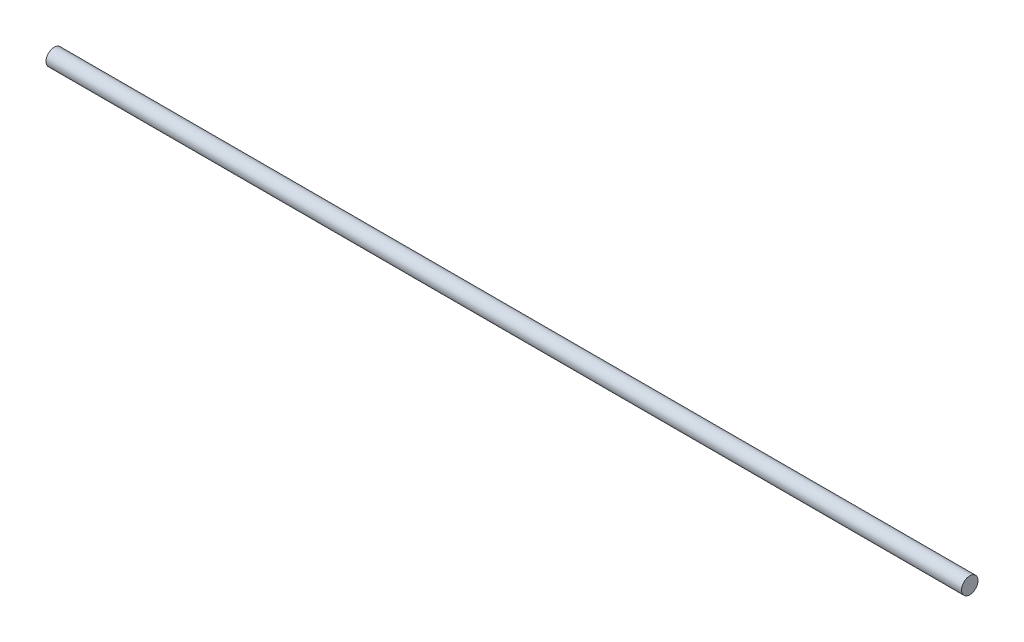
ISO-10303-21;
HEADER;
FILE_DESCRIPTION(('STEP AP214'),'2;1');
FILE_NAME('part.step','',(''),(''),'','','');
FILE_SCHEMA(('AUTOMOTIVE_DESIGN { 1 0 10303 214 1 1 1 1 }'));
ENDSEC;
DATA;
#1=APPLICATION_CONTEXT('core data for automotive mechanical design processes');
#2=APPLICATION_PROTOCOL_DEFINITION('international standard','automotive_design',2000,#1);
#3=PRODUCT_CONTEXT('',#1,'mechanical');
#4=PRODUCT('Part','Part','',(#3));
#5=PRODUCT_RELATED_PRODUCT_CATEGORY('part','',(#4));
#6=PRODUCT_DEFINITION_FORMATION('','',#4);
#7=PRODUCT_DEFINITION_CONTEXT('part definition',#1,'design');
#8=PRODUCT_DEFINITION('design','',#6,#7);
#9=PRODUCT_DEFINITION_SHAPE('','',#8);
#10=(LENGTH_UNIT() NAMED_UNIT(*) SI_UNIT(.MILLI.,.METRE.));
#11=(NAMED_UNIT(*) PLANE_ANGLE_UNIT() SI_UNIT($,.RADIAN.));
#12=(NAMED_UNIT(*) SI_UNIT($,.STERADIAN.) SOLID_ANGLE_UNIT());
#13=UNCERTAINTY_MEASURE_WITH_UNIT(LENGTH_MEASURE(1.E-05),#10,'distance_accuracy_value','');
#14=(GEOMETRIC_REPRESENTATION_CONTEXT(3) GLOBAL_UNCERTAINTY_ASSIGNED_CONTEXT((#13)) GLOBAL_UNIT_ASSIGNED_CONTEXT((#10,
#11,#12)) REPRESENTATION_CONTEXT('',''));
#15=CARTESIAN_POINT('',(0.,0.,0.));
#16=DIRECTION('',(0.,0.,1.));
#17=DIRECTION('',(1.,0.,0.));
#18=AXIS2_PLACEMENT_3D('',#15,#16,#17);
#19=CARTESIAN_POINT('',(0.,0.,0.));
#20=DIRECTION('',(-1.,0.,0.));
#21=DIRECTION('',(0.,0.,1.));
#22=AXIS2_PLACEMENT_3D('',#19,#20,#21);
#23=PLANE('',#22);
#24=CARTESIAN_POINT('',(0.,0.,0.));
#25=DIRECTION('',(-1.,0.,0.));
#26=DIRECTION('',(0.,0.,1.));
#27=AXIS2_PLACEMENT_3D('',#24,#25,#26);
#28=CIRCLE('',#27,1.5);
#29=CARTESIAN_POINT('',(0.,0.,1.5));
#30=VERTEX_POINT('',#29);
#31=EDGE_CURVE('E10',#30,#30,#28,.T.);
#32=ORIENTED_EDGE('',*,*,#31,.T.);
#33=EDGE_LOOP('',(#32));
#34=FACE_BOUND('',#33,.T.);
#35=ADVANCED_FACE('F31',(#34),#23,.T.);
#36=CARTESIAN_POINT('',(0.,0.,0.));
#37=DIRECTION('',(-1.,0.,0.));
#38=DIRECTION('',(0.,0.,1.));
#39=AXIS2_PLACEMENT_3D('',#36,#37,#38);
#40=CYLINDRICAL_SURFACE('',#39,1.5);
#41=CARTESIAN_POINT('',(167.,0.,0.));
#42=DIRECTION('',(-1.,0.,0.));
#43=DIRECTION('',(0.,0.,1.));
#44=AXIS2_PLACEMENT_3D('',#41,#42,#43);
#45=CIRCLE('',#44,1.5);
#46=CARTESIAN_POINT('',(167.,0.,1.5));
#47=VERTEX_POINT('',#46);
#48=EDGE_CURVE('E37',#47,#47,#45,.T.);
#49=ORIENTED_EDGE('',*,*,#48,.T.);
#50=EDGE_LOOP('',(#49));
#51=FACE_BOUND('',#50,.T.);
#52=ORIENTED_EDGE('',*,*,#31,.F.);
#53=EDGE_LOOP('',(#52));
#54=FACE_BOUND('',#53,.T.);
#55=ADVANCED_FACE('F43',(#51,#54),#40,.T.);
#56=CARTESIAN_POINT('',(167.,0.,0.));
#57=DIRECTION('',(1.,0.,0.));
#58=DIRECTION('',(0.,0.,-1.));
#59=AXIS2_PLACEMENT_3D('',#56,#57,#58);
#60=PLANE('',#59);
#61=ORIENTED_EDGE('',*,*,#48,.F.);
#62=EDGE_LOOP('',(#61));
#63=FACE_BOUND('',#62,.T.);
#64=ADVANCED_FACE('F46',(#63),#60,.T.);
#65=CLOSED_SHELL('',(#35,#55,#64));
#66=MANIFOLD_SOLID_BREP('B2',#65);
#67=ADVANCED_BREP_SHAPE_REPRESENTATION('',(#18,#66),#14);
#68=SHAPE_DEFINITION_REPRESENTATION(#9,#67);
ENDSEC;
END-ISO-10303-21;
